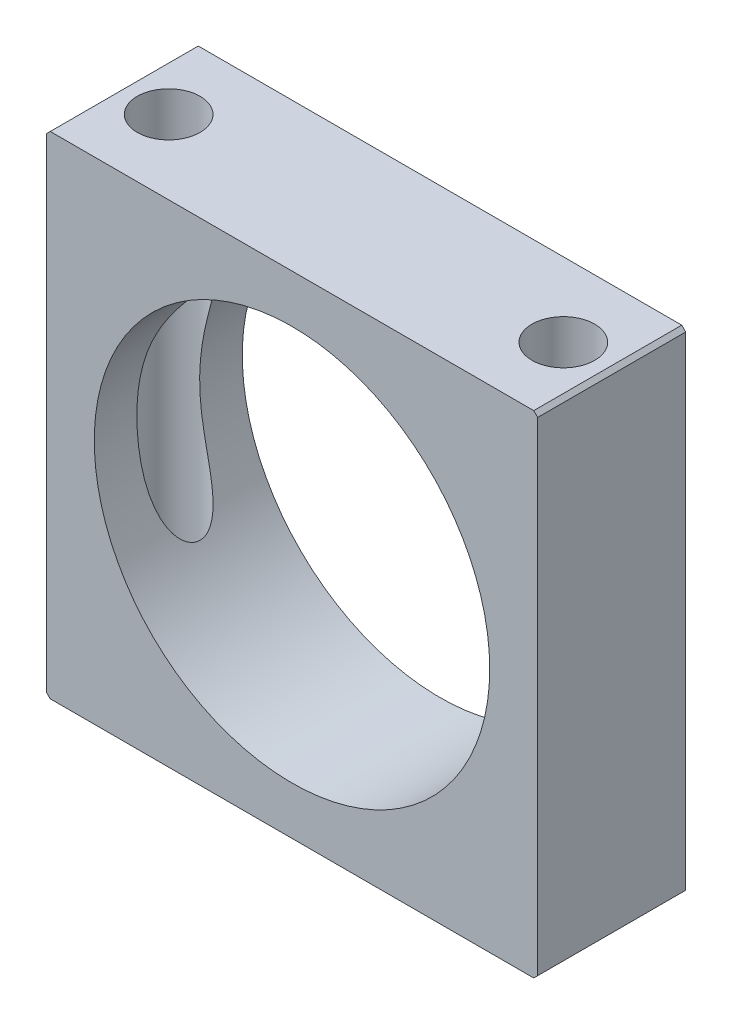
ISO-10303-21;
HEADER;
FILE_DESCRIPTION(('STEP AP214'),'2;1');
FILE_NAME('part.step','',(''),(''),'','','');
FILE_SCHEMA(('AUTOMOTIVE_DESIGN { 1 0 10303 214 1 1 1 1 }'));
ENDSEC;
DATA;
#1=APPLICATION_CONTEXT('core data for automotive mechanical design processes');
#2=APPLICATION_PROTOCOL_DEFINITION('international standard','automotive_design',2000,#1);
#3=PRODUCT_CONTEXT('',#1,'mechanical');
#4=PRODUCT('Part','Part','',(#3));
#5=PRODUCT_RELATED_PRODUCT_CATEGORY('part','',(#4));
#6=PRODUCT_DEFINITION_FORMATION('','',#4);
#7=PRODUCT_DEFINITION_CONTEXT('part definition',#1,'design');
#8=PRODUCT_DEFINITION('design','',#6,#7);
#9=PRODUCT_DEFINITION_SHAPE('','',#8);
#10=(LENGTH_UNIT() NAMED_UNIT(*) SI_UNIT(.MILLI.,.METRE.));
#11=(NAMED_UNIT(*) PLANE_ANGLE_UNIT() SI_UNIT($,.RADIAN.));
#12=(NAMED_UNIT(*) SI_UNIT($,.STERADIAN.) SOLID_ANGLE_UNIT());
#13=UNCERTAINTY_MEASURE_WITH_UNIT(LENGTH_MEASURE(1.E-05),#10,'distance_accuracy_value','');
#14=(GEOMETRIC_REPRESENTATION_CONTEXT(3) GLOBAL_UNCERTAINTY_ASSIGNED_CONTEXT((#13)) GLOBAL_UNIT_ASSIGNED_CONTEXT((#10,
#11,#12)) REPRESENTATION_CONTEXT('',''));
#15=CARTESIAN_POINT('',(0.,0.,0.));
#16=DIRECTION('',(0.,0.,1.));
#17=DIRECTION('',(1.,0.,0.));
#18=AXIS2_PLACEMENT_3D('',#15,#16,#17);
#19=CARTESIAN_POINT('',(0.,0.254000000000004,0.));
#20=DIRECTION('',(0.707106781186558,0.707106781186537,0.));
#21=DIRECTION('',(-0.707106781186537,0.707106781186558,0.));
#22=AXIS2_PLACEMENT_3D('',#19,#20,#21);
#23=PLANE('',#22);
#24=DIRECTION('',(0.,0.,1.));
#25=VECTOR('',#24,1.);
#26=CARTESIAN_POINT('',(0.253999999999997,0.,0.));
#27=LINE('',#26,#25);
#28=CARTESIAN_POINT('',(0.253999999999997,0.,9.525));
#29=VERTEX_POINT('',#28);
#30=CARTESIAN_POINT('',(0.253999999999997,0.,0.));
#31=VERTEX_POINT('',#30);
#32=EDGE_CURVE('E141',#29,#31,#27,.F.);
#33=ORIENTED_EDGE('',*,*,#32,.F.);
#34=DIRECTION('',(-0.707106781186537,0.707106781186558,0.));
#35=VECTOR('',#34,1.);
#36=CARTESIAN_POINT('',(0.,0.254000000000004,9.525));
#37=LINE('',#36,#35);
#38=CARTESIAN_POINT('',(0.,0.254000000000013,9.525));
#39=VERTEX_POINT('',#38);
#40=EDGE_CURVE('E99',#39,#29,#37,.F.);
#41=ORIENTED_EDGE('',*,*,#40,.F.);
#42=DIRECTION('',(0.,0.,1.));
#43=VECTOR('',#42,1.);
#44=CARTESIAN_POINT('',(0.,0.254000000000018,0.));
#45=LINE('',#44,#43);
#46=CARTESIAN_POINT('',(0.,0.254000000000013,0.));
#47=VERTEX_POINT('',#46);
#48=EDGE_CURVE('E98',#47,#39,#45,.T.);
#49=ORIENTED_EDGE('',*,*,#48,.F.);
#50=DIRECTION('',(0.707106781186527,-0.707106781186568,0.));
#51=VECTOR('',#50,1.);
#52=CARTESIAN_POINT('',(0.,0.254000000000015,0.));
#53=LINE('',#52,#51);
#54=EDGE_CURVE('E86',#47,#31,#53,.T.);
#55=ORIENTED_EDGE('',*,*,#54,.T.);
#56=EDGE_LOOP('',(#33,#41,#49,#55));
#57=FACE_BOUND('',#56,.T.);
#58=ADVANCED_FACE('F16',(#57),#23,.F.);
#59=CARTESIAN_POINT('',(31.369,0.,0.));
#60=DIRECTION('',(-0.707106781186547,0.707106781186548,0.));
#61=DIRECTION('',(-0.707106781186548,-0.707106781186547,0.));
#62=AXIS2_PLACEMENT_3D('',#59,#60,#61);
#63=PLANE('',#62);
#64=DIRECTION('',(0.,0.,-1.));
#65=VECTOR('',#64,1.);
#66=CARTESIAN_POINT('',(31.623,0.254000000000007,0.));
#67=LINE('',#66,#65);
#68=CARTESIAN_POINT('',(31.623,0.254000000000007,9.525));
#69=VERTEX_POINT('',#68);
#70=CARTESIAN_POINT('',(31.623,0.254000000000007,0.));
#71=VERTEX_POINT('',#70);
#72=EDGE_CURVE('E229',#69,#71,#67,.T.);
#73=ORIENTED_EDGE('',*,*,#72,.F.);
#74=DIRECTION('',(-0.707106781186548,-0.707106781186547,0.));
#75=VECTOR('',#74,1.);
#76=CARTESIAN_POINT('',(31.369,0.,9.525));
#77=LINE('',#76,#75);
#78=CARTESIAN_POINT('',(31.369,0.,9.525));
#79=VERTEX_POINT('',#78);
#80=EDGE_CURVE('E122',#79,#69,#77,.F.);
#81=ORIENTED_EDGE('',*,*,#80,.F.);
#82=DIRECTION('',(0.,0.,1.));
#83=VECTOR('',#82,1.);
#84=CARTESIAN_POINT('',(31.369,0.,0.));
#85=LINE('',#84,#83);
#86=CARTESIAN_POINT('',(31.369,0.,0.));
#87=VERTEX_POINT('',#86);
#88=EDGE_CURVE('E235',#87,#79,#85,.T.);
#89=ORIENTED_EDGE('',*,*,#88,.F.);
#90=DIRECTION('',(0.707106781186555,0.70710678118654,0.));
#91=VECTOR('',#90,1.);
#92=CARTESIAN_POINT('',(31.369,0.,0.));
#93=LINE('',#92,#91);
#94=EDGE_CURVE('E118',#87,#71,#93,.T.);
#95=ORIENTED_EDGE('',*,*,#94,.T.);
#96=EDGE_LOOP('',(#73,#81,#89,#95));
#97=FACE_BOUND('',#96,.T.);
#98=ADVANCED_FACE('F203',(#97),#63,.F.);
#99=CARTESIAN_POINT('',(28.5115,0.,4.7625));
#100=DIRECTION('',(0.,1.,0.));
#101=DIRECTION('',(0.,0.,1.));
#102=AXIS2_PLACEMENT_3D('',#99,#100,#101);
#103=CYLINDRICAL_SURFACE('',#102,2.0193);
#104=CARTESIAN_POINT('',(28.5115,0.,4.7625));
#105=DIRECTION('',(0.,1.,0.));
#106=DIRECTION('',(0.,0.,1.));
#107=AXIS2_PLACEMENT_3D('',#104,#105,#106);
#108=CIRCLE('',#107,2.0193);
#109=CARTESIAN_POINT('',(28.5115,0.,6.7818));
#110=VERTEX_POINT('',#109);
#111=EDGE_CURVE('E142',#110,#110,#108,.T.);
#112=ORIENTED_EDGE('',*,*,#111,.F.);
#113=EDGE_LOOP('',(#112));
#114=FACE_BOUND('',#113,.T.);
#115=CARTESIAN_POINT('',(28.5115,31.623,4.7625));
#116=DIRECTION('',(0.,1.,0.));
#117=DIRECTION('',(0.,0.,1.));
#118=AXIS2_PLACEMENT_3D('',#115,#116,#117);
#119=CIRCLE('',#118,2.0193);
#120=CARTESIAN_POINT('',(28.5115,31.623,6.7818));
#121=VERTEX_POINT('',#120);
#122=EDGE_CURVE('E134',#121,#121,#119,.F.);
#123=ORIENTED_EDGE('',*,*,#122,.F.);
#124=EDGE_LOOP('',(#123));
#125=FACE_BOUND('',#124,.T.);
#126=CARTESIAN_POINT('',(28.5115,16.6151200345937,2.74319999999999));
#127=CARTESIAN_POINT('',(28.5199653212104,16.4813430370531,2.74320270239754));
#128=CARTESIAN_POINT('',(28.5263158762675,16.3474399768635,2.74325062802151));
#129=CARTESIAN_POINT('',(28.5347827517717,16.0795244702182,2.74332907875549));
#130=CARTESIAN_POINT('',(28.5368999709793,15.945512053025,2.74335960755796));
#131=CARTESIAN_POINT('',(28.536900029006,15.6775559166359,2.74335990186155));
#132=CARTESIAN_POINT('',(28.5347850149188,15.5436121970708,2.7433296981734));
#133=CARTESIAN_POINT('',(28.526322201603,15.2756951322222,2.74325009105277));
#134=CARTESIAN_POINT('',(28.5199692103383,15.141721952357,2.74320066410047));
#135=CARTESIAN_POINT('',(28.5006511685445,14.836431967293,2.74319914930508));
#136=CARTESIAN_POINT('',(28.4863298494317,14.6651992426276,2.74327831319996));
#137=CARTESIAN_POINT('',(28.4507639873802,14.3234367237259,2.74403545692543));
#138=CARTESIAN_POINT('',(28.4295186182925,14.1529070158304,2.74471350822932));
#139=CARTESIAN_POINT('',(28.3801081029875,13.8126273188276,2.74732705653674));
#140=CARTESIAN_POINT('',(28.3519337391881,13.6428786777253,2.74926423423161));
#141=CARTESIAN_POINT('',(28.2887344511936,13.3047070137621,2.75527405754353));
#142=CARTESIAN_POINT('',(28.2537099752288,13.136283904916,2.75934656346674));
#143=CARTESIAN_POINT('',(28.1769646117507,12.8014278569892,2.77072658272209));
#144=CARTESIAN_POINT('',(28.1352572434751,12.6349916138971,2.77802761625686));
#145=CARTESIAN_POINT('',(28.0452092323457,12.3041426687441,2.7972347694156));
#146=CARTESIAN_POINT('',(27.9968673350173,12.1397303557952,2.80914176072264));
#147=CARTESIAN_POINT('',(27.8938736743695,11.8138519914117,2.83922573844674));
#148=CARTESIAN_POINT('',(27.8392357894094,11.6523803350742,2.85738910332814));
#149=CARTESIAN_POINT('',(27.7239329906724,11.3328225229877,2.90208533464119));
#150=CARTESIAN_POINT('',(27.6632714901554,11.1747345109502,2.92861347953247));
#151=CARTESIAN_POINT('',(27.5611040048811,10.9234282453846,2.98030993829984));
#152=CARTESIAN_POINT('',(27.5212840116499,10.8288109678863,3.00202178517003));
#153=CARTESIAN_POINT('',(27.4398400254016,10.6415939416869,3.050377247796));
#154=CARTESIAN_POINT('',(27.3982156979782,10.5489945717947,3.07702178076999));
#155=CARTESIAN_POINT('',(27.3135925758823,10.3665242495133,3.13607804401843));
#156=CARTESIAN_POINT('',(27.2705968024584,10.2766480494975,3.16847773059296));
#157=CARTESIAN_POINT('',(27.1836682807955,10.1001723616852,3.24013158612093));
#158=CARTESIAN_POINT('',(27.1397360141316,10.0135712503972,3.27938230329852));
#159=CARTESIAN_POINT('',(27.0428235727008,9.82766971518366,3.37466896265823));
#160=CARTESIAN_POINT('',(26.9897907548617,9.72929256687629,3.43249187626515));
#161=CARTESIAN_POINT('',(26.8854037535374,9.54125584218823,3.56236770191023));
#162=CARTESIAN_POINT('',(26.8340480633198,9.45158828961998,3.63440740742342));
#163=CARTESIAN_POINT('',(26.7500560588286,9.30852636786551,3.77281480481567));
#164=CARTESIAN_POINT('',(26.7161946798853,9.25199167963295,3.83515712711531));
#165=CARTESIAN_POINT('',(26.6530714006376,9.14818213783625,3.96922714840786));
#166=CARTESIAN_POINT('',(26.6238016963597,9.10089153867167,4.04093853501115));
#167=CARTESIAN_POINT('',(26.5782901191154,9.02817900877144,4.17589592751221));
#168=CARTESIAN_POINT('',(26.5606005197941,9.00022890095212,4.23727886934799));
#169=CARTESIAN_POINT('',(26.530700673956,8.9532698465948,4.36466399569805));
#170=CARTESIAN_POINT('',(26.5184864081335,8.93425434089277,4.43066275058029));
#171=CARTESIAN_POINT('',(26.5005967821325,8.90648006472163,4.56618929204118));
#172=CARTESIAN_POINT('',(26.4949681743239,8.89779462150321,4.63573869579954));
#173=CARTESIAN_POINT('',(26.4910334801698,8.89171771459723,4.77553213975767));
#174=CARTESIAN_POINT('',(26.4927247769399,8.89432221472707,4.84577592275619));
#175=CARTESIAN_POINT('',(26.502651666022,8.90967819577877,4.97686824520258));
#176=CARTESIAN_POINT('',(26.5101595332167,8.92130154238223,5.03791113034199));
#177=CARTESIAN_POINT('',(26.530196103875,8.95251309430616,5.15703949635868));
#178=CARTESIAN_POINT('',(26.5427265405966,8.97210404923387,5.21512394849178));
#179=CARTESIAN_POINT('',(26.57694270403,9.0260469027609,5.34654892578309));
#180=CARTESIAN_POINT('',(26.6002937427548,9.06315517287232,5.4183210162055));
#181=CARTESIAN_POINT('',(26.6522961811466,9.1470128956751,5.55384791767831));
#182=CARTESIAN_POINT('',(26.6809581643453,9.19378162124462,5.61758628550761));
#183=CARTESIAN_POINT('',(26.7567395024462,9.3195659189768,5.76671740611479));
#184=CARTESIAN_POINT('',(26.8059710354522,9.4030823048063,5.84720607711694));
#185=CARTESIAN_POINT('',(26.9076837203132,9.58084362320606,5.99264253749174));
#186=CARTESIAN_POINT('',(26.9601715653595,9.67511101114221,6.05755688646532));
#187=CARTESIAN_POINT('',(27.0598160898548,9.85994815666871,6.16786700297967));
#188=CARTESIAN_POINT('',(27.1069116055799,9.94974997418169,6.21463444727179));
#189=CARTESIAN_POINT('',(27.2004730258325,10.1336696801777,6.29963354602526));
#190=CARTESIAN_POINT('',(27.2469383894366,10.2277910059898,6.33785825533661));
#191=CARTESIAN_POINT('',(27.3385654476197,10.4194794845627,6.40721975903296));
#192=CARTESIAN_POINT('',(27.3837239184833,10.5170540240365,6.4383401472906));
#193=CARTESIAN_POINT('',(27.4721306897576,10.7147147019151,6.49455815108557));
#194=CARTESIAN_POINT('',(27.515379455027,10.8148002196941,6.51965723898987));
#195=CARTESIAN_POINT('',(27.6012065605999,11.020725490405,6.56566280556071));
#196=CARTESIAN_POINT('',(27.6437016974488,11.1266414750135,6.58638106462946));
#197=CARTESIAN_POINT('',(27.7260715508051,11.3402686968131,6.62333483550237));
#198=CARTESIAN_POINT('',(27.7659456990083,11.4479803170433,6.63956937753766));
#199=CARTESIAN_POINT('',(27.8814369784417,11.7735029371737,6.68275843258262));
#200=CARTESIAN_POINT('',(27.9528606496037,11.9935525731978,6.704167592949));
#201=CARTESIAN_POINT('',(28.0837726819043,12.4379435300594,6.73712794314051));
#202=CARTESIAN_POINT('',(28.1432536681567,12.6622874096153,6.74867305592211));
#203=CARTESIAN_POINT('',(28.2498686036745,13.1139815977602,6.76550530758962));
#204=CARTESIAN_POINT('',(28.2970089588245,13.3413302819456,6.77079569826742));
#205=CARTESIAN_POINT('',(28.3804709444385,13.8077062009253,6.77799711241717));
#206=CARTESIAN_POINT('',(28.4162676544204,14.0468290783341,6.77976014095217));
#207=CARTESIAN_POINT('',(28.4741517207061,14.5264596465523,6.7816630688818));
#208=CARTESIAN_POINT('',(28.4962550825482,14.7669653877115,6.78180486665852));
#209=CARTESIAN_POINT('',(28.5199653212104,15.1416569629469,6.78179729760245));
#210=CARTESIAN_POINT('',(28.5263158762675,15.2755600231365,6.78174937197848));
#211=CARTESIAN_POINT('',(28.5347827517717,15.5434755297818,6.7816709212445));
#212=CARTESIAN_POINT('',(28.5368999709793,15.677487946975,6.78164039244203));
#213=CARTESIAN_POINT('',(28.536900029006,15.9454440833641,6.78164009813845));
#214=CARTESIAN_POINT('',(28.5347850149188,16.0793878029292,6.7816703018266));
#215=CARTESIAN_POINT('',(28.526322201603,16.3473048677777,6.78174990894722));
#216=CARTESIAN_POINT('',(28.5199692103383,16.481278047643,6.78179933589952));
#217=CARTESIAN_POINT('',(28.5006511685445,16.786568032707,6.78180085069491));
#218=CARTESIAN_POINT('',(28.4863298494317,16.9578007573724,6.78172168680003));
#219=CARTESIAN_POINT('',(28.4507639873802,17.2995632762741,6.78096454307456));
#220=CARTESIAN_POINT('',(28.4295186182925,17.4700929841696,6.78028649177068));
#221=CARTESIAN_POINT('',(28.3801081029875,17.8103726811724,6.77767294346325));
#222=CARTESIAN_POINT('',(28.3519337391881,17.9801213222747,6.77573576576838));
#223=CARTESIAN_POINT('',(28.2887344511936,18.3182929862379,6.76972594245647));
#224=CARTESIAN_POINT('',(28.2537099752288,18.486716095084,6.76565343653326));
#225=CARTESIAN_POINT('',(28.1769646117507,18.8215721430108,6.75427341727791));
#226=CARTESIAN_POINT('',(28.1352572434751,18.9880083861029,6.74697238374313));
#227=CARTESIAN_POINT('',(28.0452092323457,19.3188573312559,6.7277652305844));
#228=CARTESIAN_POINT('',(27.9968673350173,19.4832696442048,6.71585823927735));
#229=CARTESIAN_POINT('',(27.8938736743695,19.8091480085883,6.68577426155325));
#230=CARTESIAN_POINT('',(27.8392357894094,19.9706196649258,6.66761089667185));
#231=CARTESIAN_POINT('',(27.7239329906724,20.2901774770123,6.6229146653588));
#232=CARTESIAN_POINT('',(27.6632714901554,20.4482654890498,6.59638652046752));
#233=CARTESIAN_POINT('',(27.5611040048811,20.6995717546154,6.54469006170015));
#234=CARTESIAN_POINT('',(27.5212840116499,20.7941890321136,6.52297821482996));
#235=CARTESIAN_POINT('',(27.4398400254016,20.9814060583131,6.47462275220399));
#236=CARTESIAN_POINT('',(27.3982156979782,21.0740054282053,6.44797821923));
#237=CARTESIAN_POINT('',(27.3135925758823,21.2564757504867,6.38892195598156));
#238=CARTESIAN_POINT('',(27.2705968024584,21.3463519505025,6.35652226940703));
#239=CARTESIAN_POINT('',(27.1836682807954,21.5228276383148,6.28486841387906));
#240=CARTESIAN_POINT('',(27.1397360141316,21.6094287496028,6.24561769670148));
#241=CARTESIAN_POINT('',(27.0428235727008,21.7953302848163,6.15033103734176));
#242=CARTESIAN_POINT('',(26.9897907548617,21.8937074331237,6.09250812373485));
#243=CARTESIAN_POINT('',(26.8854037535374,22.0817441578118,5.96263229808976));
#244=CARTESIAN_POINT('',(26.8340480633198,22.17141171038,5.89059259257657));
#245=CARTESIAN_POINT('',(26.7500560588286,22.3144736321345,5.75218519518432));
#246=CARTESIAN_POINT('',(26.7161946798853,22.371008320367,5.68984287288469));
#247=CARTESIAN_POINT('',(26.6530714006376,22.4748178621637,5.55577285159213));
#248=CARTESIAN_POINT('',(26.6238016963597,22.5221084613283,5.48406146498885));
#249=CARTESIAN_POINT('',(26.5782901191154,22.5948209912286,5.34910407248778));
#250=CARTESIAN_POINT('',(26.5606005197941,22.6227710990479,5.28772113065201));
#251=CARTESIAN_POINT('',(26.530700673956,22.6697301534052,5.16033600430194));
#252=CARTESIAN_POINT('',(26.5184864081335,22.6887456591072,5.0943372494197));
#253=CARTESIAN_POINT('',(26.5005967821325,22.7165199352784,4.95881070795881));
#254=CARTESIAN_POINT('',(26.4949681743239,22.7252053784968,4.88926130420045));
#255=CARTESIAN_POINT('',(26.4910334801698,22.7312822854028,4.74946786024232));
#256=CARTESIAN_POINT('',(26.4927247769399,22.7286777852729,4.6792240772438));
#257=CARTESIAN_POINT('',(26.502651666022,22.7133218042212,4.54813175479741));
#258=CARTESIAN_POINT('',(26.5101595332167,22.7016984576178,4.487088869658));
#259=CARTESIAN_POINT('',(26.530196103875,22.6704869056938,4.36796050364131));
#260=CARTESIAN_POINT('',(26.5427265405966,22.6508959507661,4.30987605150821));
#261=CARTESIAN_POINT('',(26.57694270403,22.5969530972391,4.1784510742169));
#262=CARTESIAN_POINT('',(26.6002937427548,22.5598448271277,4.10667898379449));
#263=CARTESIAN_POINT('',(26.6522961811466,22.4759871043249,3.97115208232168));
#264=CARTESIAN_POINT('',(26.6809581643453,22.4292183787554,3.90741371449238));
#265=CARTESIAN_POINT('',(26.7567395024462,22.3034340810232,3.7582825938852));
#266=CARTESIAN_POINT('',(26.8059710354522,22.2199176951937,3.67779392288305));
#267=CARTESIAN_POINT('',(26.9076837203132,22.0421563767939,3.53235746250825));
#268=CARTESIAN_POINT('',(26.9601715653595,21.9478889888578,3.46744311353467));
#269=CARTESIAN_POINT('',(27.0598160898548,21.7630518433313,3.35713299702032));
#270=CARTESIAN_POINT('',(27.1069116055799,21.6732500258183,3.3103655527282));
#271=CARTESIAN_POINT('',(27.2004730258325,21.4893303198223,3.22536645397473));
#272=CARTESIAN_POINT('',(27.2469383894366,21.3952089940102,3.18714174466338));
#273=CARTESIAN_POINT('',(27.3385654476197,21.2035205154373,3.11778024096703));
#274=CARTESIAN_POINT('',(27.3837239184833,21.1059459759635,3.08665985270939));
#275=CARTESIAN_POINT('',(27.4721306897576,20.9082852980849,3.03044184891442));
#276=CARTESIAN_POINT('',(27.515379455027,20.8081997803059,3.00534276101012));
#277=CARTESIAN_POINT('',(27.6012065605999,20.602274509595,2.95933719443928));
#278=CARTESIAN_POINT('',(27.6437016974488,20.4963585249865,2.93861893537053));
#279=CARTESIAN_POINT('',(27.7260715508051,20.2827313031868,2.90166516449762));
#280=CARTESIAN_POINT('',(27.7659456990083,20.1750196829567,2.88543062246233));
#281=CARTESIAN_POINT('',(27.8814369784417,19.8494970628263,2.84224156741738));
#282=CARTESIAN_POINT('',(27.9528606496037,19.6294474268022,2.82083240705099));
#283=CARTESIAN_POINT('',(28.0837726819043,19.1850564699406,2.78787205685948));
#284=CARTESIAN_POINT('',(28.1432536681567,18.9607125903847,2.77632694407788));
#285=CARTESIAN_POINT('',(28.2498686036745,18.5090184022398,2.75949469241037));
#286=CARTESIAN_POINT('',(28.2970089588245,18.2816697180544,2.75420430173257));
#287=CARTESIAN_POINT('',(28.3804709444385,17.8152937990747,2.74700288758283));
#288=CARTESIAN_POINT('',(28.4162676544204,17.5761709216659,2.74523985904783));
#289=CARTESIAN_POINT('',(28.4741517207061,17.0965403534477,2.74333693111819));
#290=CARTESIAN_POINT('',(28.4962550825482,16.8560346122885,2.74319513334148));
#291=CARTESIAN_POINT('',(28.5115,16.6151200345937,2.74319999999999));
#292=B_SPLINE_CURVE_WITH_KNOTS('',3,(#126,#127,#128,#129,#130,#131,#132,#133,#134,#135,#136,
#137,#138,#139,#140,#141,#142,#143,#144,#145,#146,#147,#148,#149,#150,#151,#152,#153,#154,#155,
#156,#157,#158,#159,#160,#161,#162,#163,#164,#165,#166,#167,#168,#169,#170,#171,#172,#173,#174,
#175,#176,#177,#178,#179,#180,#181,#182,#183,#184,#185,#186,#187,#188,#189,#190,#191,#192,#193,
#194,#195,#196,#197,#198,#199,#200,#201,#202,#203,#204,#205,#206,#207,#208,#209,#210,#211,#212,
#213,#214,#215,#216,#217,#218,#219,#220,#221,#222,#223,#224,#225,#226,#227,#228,#229,#230,#231,
#232,#233,#234,#235,#236,#237,#238,#239,#240,#241,#242,#243,#244,#245,#246,#247,#248,#249,#250,
#251,#252,#253,#254,#255,#256,#257,#258,#259,#260,#261,#262,#263,#264,#265,#266,#267,#268,#269,
#270,#271,#272,#273,#274,#275,#276,#277,#278,#279,#280,#281,#282,#283,#284,#285,#286,#287,#288,
#289,#290,#291),.UNSPECIFIED.,.T.,.F.,(4,2,2,2,2,2,2,2,2,2,2,2,2,2,2,2,2,2,2,2,2,2,2,2,2,2,2,2,
2,2,2,2,2,2,2,2,2,2,2,2,2,2,2,2,2,2,2,2,2,2,2,2,2,2,2,2,2,2,2,2,2,2,2,2,2,2,2,2,2,2,2,2,2,2,2,2,
2,2,2,2,2,2,4),(0.,0.40210354142174,0.804121705000044,1.20593596872273,1.6082434099645,
2.12358845973877,2.63899502087777,3.15509096730215,3.67115315477977,4.18618425078339,
4.70131286476891,5.21532694358039,5.72905140248845,6.04370670327851,6.35842057215425,
6.67248344208353,6.98638853111204,7.36306166959052,7.73938653512679,8.01071437980907,
8.28157596150202,8.4899567200692,8.69818426001524,8.90788123152498,9.11750324203387,
9.30444924962508,9.49145982676311,9.74236854129282,9.99378274603126,10.3696803912375,
10.7463780630539,11.0808945812981,11.4156820764171,11.7512350524477,12.0867058930888,
12.4345188051393,12.7824068857297,13.4786748948486,14.1753715521646,14.8717058416363,
15.5966898402826,16.3208248309917,16.7229283724135,17.1249465359918,17.5267607997144,
17.9290682409562,18.4444132907305,18.9598198518695,19.4759157982939,19.9919779857715,
20.5070090817751,21.0221376957606,21.5361517745721,22.0498762334802,22.3645315342702,
22.679245403146,22.9933082730753,23.3072133621038,23.6838865005822,24.0602113661185,
24.3315392108008,24.6024007924937,24.8107815510609,25.019009091007,25.2287060625167,
25.4383280730256,25.6252740806168,25.8122846577548,26.0631933722846,26.314607577023,
26.6905052222292,27.0672028940456,27.4017194122898,27.7365069074088,28.0720598834394,
28.4075307240805,28.7553436361311,29.1032317167214,29.7994997258403,30.4961963831563,
31.1925306726281,31.9175146712743,32.6416496619835),.UNSPECIFIED.);
#293=CARTESIAN_POINT('',(28.5115,16.6151200345937,2.74319999999999));
#294=VERTEX_POINT('',#293);
#295=EDGE_CURVE('E19',#294,#294,#292,.T.);
#296=ORIENTED_EDGE('',*,*,#295,.T.);
#297=EDGE_LOOP('',(#296));
#298=FACE_BOUND('',#297,.T.);
#299=ADVANCED_FACE('F171',(#114,#125,#298),#103,.F.);
#300=CARTESIAN_POINT('',(3.1115,0.,4.7625));
#301=DIRECTION('',(0.,1.,0.));
#302=DIRECTION('',(0.,0.,1.));
#303=AXIS2_PLACEMENT_3D('',#300,#301,#302);
#304=CYLINDRICAL_SURFACE('',#303,2.0193);
#305=CARTESIAN_POINT('',(3.1115,16.6151200345936,6.7818));
#306=CARTESIAN_POINT('',(3.10303467878958,16.481343037053,6.78179729760245));
#307=CARTESIAN_POINT('',(3.09668412373254,16.3474399768634,6.78174937197848));
#308=CARTESIAN_POINT('',(3.08821724822826,16.0795244702181,6.7816709212445));
#309=CARTESIAN_POINT('',(3.08610002902073,15.945512053025,6.78164039244204));
#310=CARTESIAN_POINT('',(3.08609997099397,15.677555916636,6.78164009813845));
#311=CARTESIAN_POINT('',(3.08821498508121,15.5436121970708,6.7816703018266));
#312=CARTESIAN_POINT('',(3.09667779839696,15.2756951322223,6.78174990894723));
#313=CARTESIAN_POINT('',(3.10303078966174,15.1417219523571,6.78179933589952));
#314=CARTESIAN_POINT('',(3.12234883145549,14.8364319672931,6.78180085069491));
#315=CARTESIAN_POINT('',(3.13667015056824,14.6651992426277,6.78172168680004));
#316=CARTESIAN_POINT('',(3.17223601261975,14.323436723726,6.78096454307456));
#317=CARTESIAN_POINT('',(3.1934813817075,14.1529070158306,6.78028649177068));
#318=CARTESIAN_POINT('',(3.24289189701244,13.8126273188277,6.77767294346325));
#319=CARTESIAN_POINT('',(3.27106626081184,13.6428786777255,6.77573576576838));
#320=CARTESIAN_POINT('',(3.33426554880642,13.3047070137623,6.76972594245647));
#321=CARTESIAN_POINT('',(3.36929002477115,13.1362839049161,6.76565343653326));
#322=CARTESIAN_POINT('',(3.44603538824928,12.8014278569893,6.75427341727791));
#323=CARTESIAN_POINT('',(3.48774275652484,12.6349916138972,6.74697238374314));
#324=CARTESIAN_POINT('',(3.57779076765423,12.3041426687442,6.7277652305844));
#325=CARTESIAN_POINT('',(3.6261326649827,12.1397303557953,6.71585823927736));
#326=CARTESIAN_POINT('',(3.72912632563049,11.8138519914118,6.68577426155326));
#327=CARTESIAN_POINT('',(3.78376421059059,11.6523803350743,6.66761089667187));
#328=CARTESIAN_POINT('',(3.89906700932753,11.3328225229879,6.62291466535881));
#329=CARTESIAN_POINT('',(3.95972850984452,11.1747345109503,6.59638652046754));
#330=CARTESIAN_POINT('',(4.0618959951189,10.9234282453847,6.54469006170017));
#331=CARTESIAN_POINT('',(4.1017159883501,10.8288109678864,6.52297821482998));
#332=CARTESIAN_POINT('',(4.18315997459838,10.6415939416869,6.47462275220401));
#333=CARTESIAN_POINT('',(4.22478430202177,10.5489945717947,6.44797821923002));
#334=CARTESIAN_POINT('',(4.30940742411767,10.3665242495133,6.38892195598158));
#335=CARTESIAN_POINT('',(4.35240319754159,10.2766480494976,6.35652226940705));
#336=CARTESIAN_POINT('',(4.43933171920453,10.1001723616853,6.28486841387908));
#337=CARTESIAN_POINT('',(4.48326398586839,10.0135712503973,6.24561769670149));
#338=CARTESIAN_POINT('',(4.58017642729918,9.82766971518369,6.15033103734177));
#339=CARTESIAN_POINT('',(4.6332092451383,9.72929256687632,6.09250812373486));
#340=CARTESIAN_POINT('',(4.7375962464626,9.54125584218826,5.96263229808978));
#341=CARTESIAN_POINT('',(4.78895193668016,9.45158828962002,5.89059259257659));
#342=CARTESIAN_POINT('',(4.87294394117134,9.30852636786555,5.75218519518435));
#343=CARTESIAN_POINT('',(4.90680532011464,9.25199167963299,5.68984287288471));
#344=CARTESIAN_POINT('',(4.96992859936243,9.14818213783628,5.55577285159216));
#345=CARTESIAN_POINT('',(4.99919830364024,9.1008915386717,5.48406146498887));
#346=CARTESIAN_POINT('',(5.04470988088462,9.02817900877146,5.3491040724878));
#347=CARTESIAN_POINT('',(5.06239948020592,9.00022890095214,5.28772113065203));
#348=CARTESIAN_POINT('',(5.09229932604396,8.95326984659481,5.16033600430196));
#349=CARTESIAN_POINT('',(5.10451359186649,8.93425434089279,5.09433724941972));
#350=CARTESIAN_POINT('',(5.12240321786751,8.90648006472165,4.95881070795883));
#351=CARTESIAN_POINT('',(5.12803182567607,8.89779462150323,4.88926130420047));
#352=CARTESIAN_POINT('',(5.13196651983023,8.89171771459725,4.74946786024234));
#353=CARTESIAN_POINT('',(5.13027522306011,8.89432221472708,4.67922407724382));
#354=CARTESIAN_POINT('',(5.12034833397796,8.90967819577878,4.54813175479743));
#355=CARTESIAN_POINT('',(5.11284046678328,8.92130154238224,4.48708886965802));
#356=CARTESIAN_POINT('',(5.09280389612503,8.95251309430617,4.36796050364133));
#357=CARTESIAN_POINT('',(5.08027345940335,8.97210404923388,4.30987605150823));
#358=CARTESIAN_POINT('',(5.04605729597002,9.02604690276091,4.17845107421692));
#359=CARTESIAN_POINT('',(5.02270625724518,9.06315517287233,4.10667898379451));
#360=CARTESIAN_POINT('',(4.97070381885335,9.1470128956751,3.9711520823217));
#361=CARTESIAN_POINT('',(4.94204183565467,9.19378162124462,3.9074137144924));
#362=CARTESIAN_POINT('',(4.86626049755376,9.3195659189768,3.75828259388523));
#363=CARTESIAN_POINT('',(4.81702896454783,9.4030823048063,3.67779392288308));
#364=CARTESIAN_POINT('',(4.71531627968681,9.58084362320606,3.53235746250828));
#365=CARTESIAN_POINT('',(4.66282843464055,9.6751110111422,3.4674431135347));
#366=CARTESIAN_POINT('',(4.56318391014516,9.8599481566687,3.35713299702035));
#367=CARTESIAN_POINT('',(4.5160883944201,9.94974997418167,3.31036555272823));
#368=CARTESIAN_POINT('',(4.42252697416751,10.1336696801777,3.22536645397475));
#369=CARTESIAN_POINT('',(4.37606161056346,10.2277910059898,3.1871417446634));
#370=CARTESIAN_POINT('',(4.28443455238028,10.4194794845627,3.11778024096705));
#371=CARTESIAN_POINT('',(4.23927608151668,10.5170540240364,3.08665985270942));
#372=CARTESIAN_POINT('',(4.15086931024237,10.7147147019151,3.03044184891444));
#373=CARTESIAN_POINT('',(4.10762054497305,10.8148002196941,3.00534276101014));
#374=CARTESIAN_POINT('',(4.02179343940012,11.020725490405,2.9593371944393));
#375=CARTESIAN_POINT('',(3.97929830255117,11.1266414750134,2.93861893537055));
#376=CARTESIAN_POINT('',(3.89692844919489,11.3402686968131,2.90166516449764));
#377=CARTESIAN_POINT('',(3.85705430099169,11.4479803170432,2.88543062246235));
#378=CARTESIAN_POINT('',(3.74156302155836,11.7735029371737,2.84224156741739));
#379=CARTESIAN_POINT('',(3.67013935039628,11.9935525731977,2.820832407051));
#380=CARTESIAN_POINT('',(3.53922731809574,12.4379435300593,2.78787205685949));
#381=CARTESIAN_POINT('',(3.47974633184333,12.6622874096152,2.77632694407789));
#382=CARTESIAN_POINT('',(3.37313139632555,13.1139815977601,2.75949469241038));
#383=CARTESIAN_POINT('',(3.32599104117548,13.3413302819455,2.75420430173258));
#384=CARTESIAN_POINT('',(3.2425290555615,13.8077062009252,2.74700288758283));
#385=CARTESIAN_POINT('',(3.20673234557958,14.046829078334,2.74523985904783));
#386=CARTESIAN_POINT('',(3.14884827929394,14.5264596465523,2.7433369311182));
#387=CARTESIAN_POINT('',(3.12674491745181,14.7669653877116,2.74319513334148));
#388=CARTESIAN_POINT('',(3.10303467878959,15.141656962947,2.74320270239755));
#389=CARTESIAN_POINT('',(3.09668412373254,15.2755600231366,2.74325062802152));
#390=CARTESIAN_POINT('',(3.08821724822826,15.5434755297819,2.7433290787555));
#391=CARTESIAN_POINT('',(3.08610002902073,15.677487946975,2.74335960755796));
#392=CARTESIAN_POINT('',(3.08609997099397,15.945444083364,2.74335990186155));
#393=CARTESIAN_POINT('',(3.08821498508121,16.0793878029292,2.7433296981734));
#394=CARTESIAN_POINT('',(3.09667779839696,16.3473048677777,2.74325009105277));
#395=CARTESIAN_POINT('',(3.10303078966174,16.4812780476429,2.74320066410048));
#396=CARTESIAN_POINT('',(3.12234883145549,16.7865680327069,2.74319914930509));
#397=CARTESIAN_POINT('',(3.13667015056824,16.9578007573723,2.74327831319997));
#398=CARTESIAN_POINT('',(3.17223601261975,17.299563276274,2.74403545692544));
#399=CARTESIAN_POINT('',(3.1934813817075,17.4700929841694,2.74471350822932));
#400=CARTESIAN_POINT('',(3.24289189701244,17.8103726811723,2.74732705653675));
#401=CARTESIAN_POINT('',(3.27106626081184,17.9801213222745,2.74926423423162));
#402=CARTESIAN_POINT('',(3.33426554880642,18.3182929862377,2.75527405754353));
#403=CARTESIAN_POINT('',(3.36929002477116,18.4867160950839,2.75934656346674));
#404=CARTESIAN_POINT('',(3.44603538824928,18.8215721430107,2.77072658272209));
#405=CARTESIAN_POINT('',(3.48774275652484,18.9880083861028,2.77802761625686));
#406=CARTESIAN_POINT('',(3.57779076765423,19.3188573312558,2.7972347694156));
#407=CARTESIAN_POINT('',(3.6261326649827,19.4832696442047,2.80914176072264));
#408=CARTESIAN_POINT('',(3.72912632563049,19.8091480085882,2.83922573844674));
#409=CARTESIAN_POINT('',(3.78376421059059,19.9706196649257,2.85738910332813));
#410=CARTESIAN_POINT('',(3.89906700932753,20.2901774770121,2.90208533464118));
#411=CARTESIAN_POINT('',(3.95972850984451,20.4482654890497,2.92861347953246));
#412=CARTESIAN_POINT('',(4.06189599511889,20.6995717546153,2.98030993829983));
#413=CARTESIAN_POINT('',(4.1017159883501,20.7941890321135,3.00202178517002));
#414=CARTESIAN_POINT('',(4.18315997459838,20.9814060583131,3.05037724779599));
#415=CARTESIAN_POINT('',(4.22478430202177,21.0740054282053,3.07702178076998));
#416=CARTESIAN_POINT('',(4.30940742411767,21.2564757504867,3.13607804401842));
#417=CARTESIAN_POINT('',(4.35240319754159,21.3463519505024,3.16847773059295));
#418=CARTESIAN_POINT('',(4.43933171920453,21.5228276383147,3.24013158612092));
#419=CARTESIAN_POINT('',(4.48326398586839,21.6094287496027,3.27938230329851));
#420=CARTESIAN_POINT('',(4.58017642729917,21.7953302848163,3.37466896265823));
#421=CARTESIAN_POINT('',(4.6332092451383,21.8937074331237,3.43249187626514));
#422=CARTESIAN_POINT('',(4.7375962464626,22.0817441578117,3.56236770191022));
#423=CARTESIAN_POINT('',(4.78895193668016,22.17141171038,3.63440740742341));
#424=CARTESIAN_POINT('',(4.87294394117134,22.3144736321345,3.77281480481565));
#425=CARTESIAN_POINT('',(4.90680532011464,22.371008320367,3.83515712711529));
#426=CARTESIAN_POINT('',(4.96992859936243,22.4748178621637,3.96922714840784));
#427=CARTESIAN_POINT('',(4.99919830364024,22.5221084613283,4.04093853501113));
#428=CARTESIAN_POINT('',(5.04470988088462,22.5948209912285,4.1758959275122));
#429=CARTESIAN_POINT('',(5.06239948020592,22.6227710990479,4.23727886934797));
#430=CARTESIAN_POINT('',(5.09229932604396,22.6697301534052,4.36466399569803));
#431=CARTESIAN_POINT('',(5.10451359186649,22.6887456591072,4.43066275058027));
#432=CARTESIAN_POINT('',(5.12240321786751,22.7165199352784,4.56618929204116));
#433=CARTESIAN_POINT('',(5.12803182567607,22.7252053784968,4.63573869579952));
#434=CARTESIAN_POINT('',(5.13196651983022,22.7312822854027,4.77553213975766));
#435=CARTESIAN_POINT('',(5.13027522306011,22.7286777852729,4.84577592275618));
#436=CARTESIAN_POINT('',(5.12034833397796,22.7133218042212,4.97686824520257));
#437=CARTESIAN_POINT('',(5.11284046678328,22.7016984576178,5.03791113034198));
#438=CARTESIAN_POINT('',(5.09280389612503,22.6704869056938,5.15703949635867));
#439=CARTESIAN_POINT('',(5.08027345940335,22.6508959507661,5.21512394849176));
#440=CARTESIAN_POINT('',(5.04605729597002,22.5969530972391,5.34654892578307));
#441=CARTESIAN_POINT('',(5.02270625724518,22.5598448271277,5.41832101620549));
#442=CARTESIAN_POINT('',(4.97070381885335,22.4759871043249,5.55384791767829));
#443=CARTESIAN_POINT('',(4.94204183565467,22.4292183787554,5.61758628550759));
#444=CARTESIAN_POINT('',(4.86626049755376,22.3034340810232,5.76671740611477));
#445=CARTESIAN_POINT('',(4.81702896454783,22.2199176951937,5.84720607711692));
#446=CARTESIAN_POINT('',(4.71531627968682,22.042156376794,5.99264253749171));
#447=CARTESIAN_POINT('',(4.66282843464056,21.9478889888578,6.05755688646529));
#448=CARTESIAN_POINT('',(4.56318391014517,21.7630518433313,6.16786700297965));
#449=CARTESIAN_POINT('',(4.5160883944201,21.6732500258183,6.21463444727176));
#450=CARTESIAN_POINT('',(4.42252697416752,21.4893303198223,6.29963354602524));
#451=CARTESIAN_POINT('',(4.37606161056347,21.3952089940102,6.33785825533659));
#452=CARTESIAN_POINT('',(4.28443455238029,21.2035205154373,6.40721975903294));
#453=CARTESIAN_POINT('',(4.23927608151669,21.1059459759636,6.43834014729058));
#454=CARTESIAN_POINT('',(4.15086931024238,20.9082852980849,6.49455815108555));
#455=CARTESIAN_POINT('',(4.10762054497306,20.8081997803059,6.51965723898986));
#456=CARTESIAN_POINT('',(4.02179343940013,20.6022745095951,6.5656628055607));
#457=CARTESIAN_POINT('',(3.97929830255118,20.4963585249866,6.58638106462944));
#458=CARTESIAN_POINT('',(3.8969284491949,20.2827313031869,6.62333483550236));
#459=CARTESIAN_POINT('',(3.85705430099171,20.1750196829568,6.63956937753765));
#460=CARTESIAN_POINT('',(3.74156302155837,19.8494970628264,6.68275843258261));
#461=CARTESIAN_POINT('',(3.67013935039629,19.6294474268023,6.70416759294899));
#462=CARTESIAN_POINT('',(3.53922731809575,19.1850564699407,6.73712794314051));
#463=CARTESIAN_POINT('',(3.47974633184335,18.9607125903848,6.74867305592211));
#464=CARTESIAN_POINT('',(3.37313139632556,18.5090184022399,6.76550530758962));
#465=CARTESIAN_POINT('',(3.32599104117549,18.2816697180546,6.77079569826742));
#466=CARTESIAN_POINT('',(3.24252905556151,17.8152937990748,6.77799711241717));
#467=CARTESIAN_POINT('',(3.20673234557958,17.576170921666,6.77976014095217));
#468=CARTESIAN_POINT('',(3.14884827929394,17.0965403534477,6.7816630688818));
#469=CARTESIAN_POINT('',(3.12674491745181,16.8560346122884,6.78180486665852));
#470=CARTESIAN_POINT('',(3.1115,16.6151200345936,6.7818));
#471=B_SPLINE_CURVE_WITH_KNOTS('',3,(#305,#306,#307,#308,#309,#310,#311,#312,#313,#314,#315,
#316,#317,#318,#319,#320,#321,#322,#323,#324,#325,#326,#327,#328,#329,#330,#331,#332,#333,#334,
#335,#336,#337,#338,#339,#340,#341,#342,#343,#344,#345,#346,#347,#348,#349,#350,#351,#352,#353,
#354,#355,#356,#357,#358,#359,#360,#361,#362,#363,#364,#365,#366,#367,#368,#369,#370,#371,#372,
#373,#374,#375,#376,#377,#378,#379,#380,#381,#382,#383,#384,#385,#386,#387,#388,#389,#390,#391,
#392,#393,#394,#395,#396,#397,#398,#399,#400,#401,#402,#403,#404,#405,#406,#407,#408,#409,#410,
#411,#412,#413,#414,#415,#416,#417,#418,#419,#420,#421,#422,#423,#424,#425,#426,#427,#428,#429,
#430,#431,#432,#433,#434,#435,#436,#437,#438,#439,#440,#441,#442,#443,#444,#445,#446,#447,#448,
#449,#450,#451,#452,#453,#454,#455,#456,#457,#458,#459,#460,#461,#462,#463,#464,#465,#466,#467,
#468,#469,#470),.UNSPECIFIED.,.T.,.F.,(4,2,2,2,2,2,2,2,2,2,2,2,2,2,2,2,2,2,2,2,2,2,2,2,2,2,2,2,
2,2,2,2,2,2,2,2,2,2,2,2,2,2,2,2,2,2,2,2,2,2,2,2,2,2,2,2,2,2,2,2,2,2,2,2,2,2,2,2,2,2,2,2,2,2,2,2,
2,2,2,2,2,2,4),(0.,0.402103541421681,0.804121704999922,1.20593596872255,1.60824340996427,
2.12358845973853,2.63899502087753,3.15509096730192,3.67115315477953,4.18618425078316,
4.70131286476868,5.21532694358015,5.72905140248821,6.04370670327829,6.35842057215406,
6.67248344208336,6.98638853111189,7.36306166959035,7.73938653512661,8.0107143798089,
8.28157596150186,8.48995672006905,8.69818426001509,8.90788123152483,9.11750324203372,
9.30444924962494,9.49145982676296,9.74236854129267,9.9937827460311,10.3696803912373,
10.7463780630537,11.0808945812979,11.4156820764169,11.7512350524475,12.0867058930886,
12.4345188051391,12.7824068857295,13.4786748948484,14.1753715521643,14.8717058416361,
15.5966898402824,16.3208248309917,16.7229283724134,17.1249465359916,17.5267607997142,
17.9290682409559,18.4444132907302,18.9598198518692,19.4759157982936,19.9919779857712,
20.5070090817748,21.0221376957603,21.5361517745718,22.0498762334799,22.36453153427,
22.6792454031457,22.993308273075,23.3072133621036,23.683886500582,24.0602113661183,
24.3315392108006,24.6024007924935,24.8107815510607,25.0190090910068,25.2287060625165,
25.4383280730254,25.6252740806166,25.8122846577546,26.0631933722843,26.3146075770228,
26.690505222229,27.0672028940454,27.4017194122895,27.7365069074086,28.0720598834391,
28.4075307240802,28.7553436361307,29.1032317167211,29.79949972584,30.4961963831559,
31.1925306726277,31.9175146712741,32.6416496619834),.UNSPECIFIED.);
#472=CARTESIAN_POINT('',(3.1115,16.6151200345936,6.7818));
#473=VERTEX_POINT('',#472);
#474=EDGE_CURVE('E110',#473,#473,#471,.T.);
#475=ORIENTED_EDGE('',*,*,#474,.T.);
#476=EDGE_LOOP('',(#475));
#477=FACE_BOUND('',#476,.T.);
#478=CARTESIAN_POINT('',(3.1115,31.623,4.7625));
#479=DIRECTION('',(0.,1.,0.));
#480=DIRECTION('',(0.,0.,1.));
#481=AXIS2_PLACEMENT_3D('',#478,#479,#480);
#482=CIRCLE('',#481,2.0193);
#483=CARTESIAN_POINT('',(3.1115,31.623,6.7818));
#484=VERTEX_POINT('',#483);
#485=EDGE_CURVE('E130',#484,#484,#482,.F.);
#486=ORIENTED_EDGE('',*,*,#485,.F.);
#487=EDGE_LOOP('',(#486));
#488=FACE_BOUND('',#487,.T.);
#489=CARTESIAN_POINT('',(3.1115,0.,4.7625));
#490=DIRECTION('',(0.,1.,0.));
#491=DIRECTION('',(0.,0.,1.));
#492=AXIS2_PLACEMENT_3D('',#489,#490,#491);
#493=CIRCLE('',#492,2.0193);
#494=CARTESIAN_POINT('',(3.1115,0.,6.7818));
#495=VERTEX_POINT('',#494);
#496=EDGE_CURVE('E138',#495,#495,#493,.T.);
#497=ORIENTED_EDGE('',*,*,#496,.F.);
#498=EDGE_LOOP('',(#497));
#499=FACE_BOUND('',#498,.T.);
#500=ADVANCED_FACE('F149',(#477,#488,#499),#304,.F.);
#501=CARTESIAN_POINT('',(31.623,31.369,0.));
#502=DIRECTION('',(-0.707106781186548,-0.707106781186548,0.));
#503=DIRECTION('',(0.707106781186548,-0.707106781186548,0.));
#504=AXIS2_PLACEMENT_3D('',#501,#502,#503);
#505=PLANE('',#504);
#506=DIRECTION('',(0.,0.,1.));
#507=VECTOR('',#506,1.);
#508=CARTESIAN_POINT('',(31.369,31.623,0.));
#509=LINE('',#508,#507);
#510=CARTESIAN_POINT('',(31.369,31.623,9.525));
#511=VERTEX_POINT('',#510);
#512=CARTESIAN_POINT('',(31.369,31.623,0.));
#513=VERTEX_POINT('',#512);
#514=EDGE_CURVE('E133',#511,#513,#509,.F.);
#515=ORIENTED_EDGE('',*,*,#514,.F.);
#516=DIRECTION('',(0.707106781186548,-0.707106781186548,0.));
#517=VECTOR('',#516,1.);
#518=CARTESIAN_POINT('',(31.623,31.369,9.525));
#519=LINE('',#518,#517);
#520=CARTESIAN_POINT('',(31.623,31.369,9.525));
#521=VERTEX_POINT('',#520);
#522=EDGE_CURVE('E120',#521,#511,#519,.F.);
#523=ORIENTED_EDGE('',*,*,#522,.F.);
#524=DIRECTION('',(0.,0.,-1.));
#525=VECTOR('',#524,1.);
#526=CARTESIAN_POINT('',(31.623,31.369,0.));
#527=LINE('',#526,#525);
#528=CARTESIAN_POINT('',(31.623,31.369,0.));
#529=VERTEX_POINT('',#528);
#530=EDGE_CURVE('E137',#529,#521,#527,.F.);
#531=ORIENTED_EDGE('',*,*,#530,.F.);
#532=DIRECTION('',(-0.707106781186538,0.707106781186557,0.));
#533=VECTOR('',#532,1.);
#534=CARTESIAN_POINT('',(31.623,31.369,0.));
#535=LINE('',#534,#533);
#536=EDGE_CURVE('E95',#529,#513,#535,.T.);
#537=ORIENTED_EDGE('',*,*,#536,.T.);
#538=EDGE_LOOP('',(#515,#523,#531,#537));
#539=FACE_BOUND('',#538,.T.);
#540=ADVANCED_FACE('F164',(#539),#505,.F.);
#541=CARTESIAN_POINT('',(0.,0.,0.));
#542=DIRECTION('',(0.,0.,1.));
#543=DIRECTION('',(1.,0.,0.));
#544=AXIS2_PLACEMENT_3D('',#541,#542,#543);
#545=PLANE('',#544);
#546=ORIENTED_EDGE('',*,*,#54,.F.);
#547=DIRECTION('',(0.,-1.,0.));
#548=VECTOR('',#547,1.);
#549=CARTESIAN_POINT('',(0.,31.623,0.));
#550=LINE('',#549,#548);
#551=CARTESIAN_POINT('',(0.,31.369,0.));
#552=VERTEX_POINT('',#551);
#553=EDGE_CURVE('E83',#552,#47,#550,.T.);
#554=ORIENTED_EDGE('',*,*,#553,.F.);
#555=DIRECTION('',(0.707106781186549,0.707106781186546,0.));
#556=VECTOR('',#555,1.);
#557=CARTESIAN_POINT('',(0.253999999999997,31.623,0.));
#558=LINE('',#557,#556);
#559=CARTESIAN_POINT('',(0.253999999999993,31.623,0.));
#560=VERTEX_POINT('',#559);
#561=EDGE_CURVE('E114',#552,#560,#558,.T.);
#562=ORIENTED_EDGE('',*,*,#561,.T.);
#563=DIRECTION('',(1.,0.,0.));
#564=VECTOR('',#563,1.);
#565=CARTESIAN_POINT('',(31.623,31.623,0.));
#566=LINE('',#565,#564);
#567=EDGE_CURVE('E247',#513,#560,#566,.F.);
#568=ORIENTED_EDGE('',*,*,#567,.F.);
#569=ORIENTED_EDGE('',*,*,#536,.F.);
#570=DIRECTION('',(0.,1.,0.));
#571=VECTOR('',#570,1.);
#572=CARTESIAN_POINT('',(31.623,0.,0.));
#573=LINE('',#572,#571);
#574=EDGE_CURVE('E234',#71,#529,#573,.T.);
#575=ORIENTED_EDGE('',*,*,#574,.F.);
#576=ORIENTED_EDGE('',*,*,#94,.F.);
#577=DIRECTION('',(1.,0.,0.));
#578=VECTOR('',#577,1.);
#579=CARTESIAN_POINT('',(0.,0.,0.));
#580=LINE('',#579,#578);
#581=EDGE_CURVE('E91',#31,#87,#580,.T.);
#582=ORIENTED_EDGE('',*,*,#581,.F.);
#583=EDGE_LOOP('',(#546,#554,#562,#568,#569,#575,#576,#582));
#584=FACE_BOUND('',#583,.T.);
#585=CARTESIAN_POINT('',(15.8115,15.8115,0.));
#586=DIRECTION('',(0.,0.,1.));
#587=DIRECTION('',(1.,0.,0.));
#588=AXIS2_PLACEMENT_3D('',#585,#586,#587);
#589=CIRCLE('',#588,12.7254);
#590=CARTESIAN_POINT('',(28.5369,15.8115,0.));
#591=VERTEX_POINT('',#590);
#592=EDGE_CURVE('E107',#591,#591,#589,.T.);
#593=ORIENTED_EDGE('',*,*,#592,.T.);
#594=EDGE_LOOP('',(#593));
#595=FACE_BOUND('',#594,.T.);
#596=ADVANCED_FACE('F88',(#584,#595),#545,.F.);
#597=CARTESIAN_POINT('',(0.253999999999997,31.623,0.));
#598=DIRECTION('',(0.707106781186546,-0.707106781186549,0.));
#599=DIRECTION('',(0.707106781186549,0.707106781186546,0.));
#600=AXIS2_PLACEMENT_3D('',#597,#598,#599);
#601=PLANE('',#600);
#602=DIRECTION('',(0.,0.,1.));
#603=VECTOR('',#602,1.);
#604=CARTESIAN_POINT('',(0.,31.369,0.));
#605=LINE('',#604,#603);
#606=CARTESIAN_POINT('',(0.,31.369,9.525));
#607=VERTEX_POINT('',#606);
#608=EDGE_CURVE('E103',#607,#552,#605,.F.);
#609=ORIENTED_EDGE('',*,*,#608,.F.);
#610=DIRECTION('',(0.707106781186549,0.707106781186546,0.));
#611=VECTOR('',#610,1.);
#612=CARTESIAN_POINT('',(0.253999999999997,31.623,9.525));
#613=LINE('',#612,#611);
#614=CARTESIAN_POINT('',(0.253999999999994,31.623,9.525));
#615=VERTEX_POINT('',#614);
#616=EDGE_CURVE('E39',#615,#607,#613,.F.);
#617=ORIENTED_EDGE('',*,*,#616,.F.);
#618=DIRECTION('',(0.,0.,1.));
#619=VECTOR('',#618,1.);
#620=CARTESIAN_POINT('',(0.25399999999999,31.623,0.));
#621=LINE('',#620,#619);
#622=EDGE_CURVE('E129',#560,#615,#621,.T.);
#623=ORIENTED_EDGE('',*,*,#622,.F.);
#624=ORIENTED_EDGE('',*,*,#561,.F.);
#625=EDGE_LOOP('',(#609,#617,#623,#624));
#626=FACE_BOUND('',#625,.T.);
#627=ADVANCED_FACE('F157',(#626),#601,.F.);
#628=CARTESIAN_POINT('',(15.8115,15.8115,9.525));
#629=DIRECTION('',(0.,0.,1.));
#630=DIRECTION('',(1.,0.,0.));
#631=AXIS2_PLACEMENT_3D('',#628,#629,#630);
#632=CYLINDRICAL_SURFACE('',#631,12.7254);
#633=ORIENTED_EDGE('',*,*,#295,.F.);
#634=EDGE_LOOP('',(#633));
#635=FACE_BOUND('',#634,.T.);
#636=CARTESIAN_POINT('',(15.8115,15.8115,9.525));
#637=DIRECTION('',(0.,0.,1.));
#638=DIRECTION('',(1.,0.,0.));
#639=AXIS2_PLACEMENT_3D('',#636,#637,#638);
#640=CIRCLE('',#639,12.7254);
#641=CARTESIAN_POINT('',(28.5369,15.8115,9.525));
#642=VERTEX_POINT('',#641);
#643=EDGE_CURVE('E125',#642,#642,#640,.F.);
#644=ORIENTED_EDGE('',*,*,#643,.F.);
#645=EDGE_LOOP('',(#644));
#646=FACE_BOUND('',#645,.T.);
#647=ORIENTED_EDGE('',*,*,#474,.F.);
#648=EDGE_LOOP('',(#647));
#649=FACE_BOUND('',#648,.T.);
#650=ORIENTED_EDGE('',*,*,#592,.F.);
#651=EDGE_LOOP('',(#650));
#652=FACE_BOUND('',#651,.T.);
#653=ADVANCED_FACE('F152',(#635,#646,#649,#652),#632,.F.);
#654=CARTESIAN_POINT('',(0.,31.623,0.));
#655=DIRECTION('',(-1.,0.,0.));
#656=DIRECTION('',(0.,-1.,0.));
#657=AXIS2_PLACEMENT_3D('',#654,#655,#656);
#658=PLANE('',#657);
#659=DIRECTION('',(0.,1.,0.));
#660=VECTOR('',#659,1.);
#661=CARTESIAN_POINT('',(0.,0.,9.525));
#662=LINE('',#661,#660);
#663=EDGE_CURVE('E128',#607,#39,#662,.F.);
#664=ORIENTED_EDGE('',*,*,#663,.F.);
#665=ORIENTED_EDGE('',*,*,#608,.T.);
#666=ORIENTED_EDGE('',*,*,#553,.T.);
#667=ORIENTED_EDGE('',*,*,#48,.T.);
#668=EDGE_LOOP('',(#664,#665,#666,#667));
#669=FACE_BOUND('',#668,.T.);
#670=ADVANCED_FACE('F106',(#669),#658,.T.);
#671=CARTESIAN_POINT('',(0.,0.,0.));
#672=DIRECTION('',(0.,-1.,0.));
#673=DIRECTION('',(1.,0.,0.));
#674=AXIS2_PLACEMENT_3D('',#671,#672,#673);
#675=PLANE('',#674);
#676=ORIENTED_EDGE('',*,*,#581,.T.);
#677=ORIENTED_EDGE('',*,*,#88,.T.);
#678=DIRECTION('',(1.,0.,0.));
#679=VECTOR('',#678,1.);
#680=CARTESIAN_POINT('',(0.,0.,9.525));
#681=LINE('',#680,#679);
#682=EDGE_CURVE('E240',#29,#79,#681,.T.);
#683=ORIENTED_EDGE('',*,*,#682,.F.);
#684=ORIENTED_EDGE('',*,*,#32,.T.);
#685=EDGE_LOOP('',(#676,#677,#683,#684));
#686=FACE_BOUND('',#685,.T.);
#687=ORIENTED_EDGE('',*,*,#496,.T.);
#688=EDGE_LOOP('',(#687));
#689=FACE_BOUND('',#688,.T.);
#690=ORIENTED_EDGE('',*,*,#111,.T.);
#691=EDGE_LOOP('',(#690));
#692=FACE_BOUND('',#691,.T.);
#693=ADVANCED_FACE('F188',(#686,#689,#692),#675,.T.);
#694=CARTESIAN_POINT('',(31.623,0.,0.));
#695=DIRECTION('',(1.,0.,0.));
#696=DIRECTION('',(0.,0.,-1.));
#697=AXIS2_PLACEMENT_3D('',#694,#695,#696);
#698=PLANE('',#697);
#699=ORIENTED_EDGE('',*,*,#574,.T.);
#700=ORIENTED_EDGE('',*,*,#530,.T.);
#701=DIRECTION('',(0.,1.,0.));
#702=VECTOR('',#701,1.);
#703=CARTESIAN_POINT('',(31.623,0.,9.525));
#704=LINE('',#703,#702);
#705=EDGE_CURVE('E30',#69,#521,#704,.T.);
#706=ORIENTED_EDGE('',*,*,#705,.F.);
#707=ORIENTED_EDGE('',*,*,#72,.T.);
#708=EDGE_LOOP('',(#699,#700,#706,#707));
#709=FACE_BOUND('',#708,.T.);
#710=ADVANCED_FACE('F182',(#709),#698,.T.);
#711=CARTESIAN_POINT('',(31.623,31.623,0.));
#712=DIRECTION('',(0.,1.,0.));
#713=DIRECTION('',(0.,0.,1.));
#714=AXIS2_PLACEMENT_3D('',#711,#712,#713);
#715=PLANE('',#714);
#716=ORIENTED_EDGE('',*,*,#567,.T.);
#717=ORIENTED_EDGE('',*,*,#622,.T.);
#718=DIRECTION('',(1.,0.,0.));
#719=VECTOR('',#718,1.);
#720=CARTESIAN_POINT('',(0.,31.623,9.525));
#721=LINE('',#720,#719);
#722=EDGE_CURVE('E11',#511,#615,#721,.F.);
#723=ORIENTED_EDGE('',*,*,#722,.F.);
#724=ORIENTED_EDGE('',*,*,#514,.T.);
#725=EDGE_LOOP('',(#716,#717,#723,#724));
#726=FACE_BOUND('',#725,.T.);
#727=ORIENTED_EDGE('',*,*,#485,.T.);
#728=EDGE_LOOP('',(#727));
#729=FACE_BOUND('',#728,.T.);
#730=ORIENTED_EDGE('',*,*,#122,.T.);
#731=EDGE_LOOP('',(#730));
#732=FACE_BOUND('',#731,.T.);
#733=ADVANCED_FACE('F176',(#726,#729,#732),#715,.T.);
#734=CARTESIAN_POINT('',(0.,0.,9.525));
#735=DIRECTION('',(0.,0.,1.));
#736=DIRECTION('',(1.,0.,0.));
#737=AXIS2_PLACEMENT_3D('',#734,#735,#736);
#738=PLANE('',#737);
#739=ORIENTED_EDGE('',*,*,#722,.T.);
#740=ORIENTED_EDGE('',*,*,#616,.T.);
#741=ORIENTED_EDGE('',*,*,#663,.T.);
#742=ORIENTED_EDGE('',*,*,#40,.T.);
#743=ORIENTED_EDGE('',*,*,#682,.T.);
#744=ORIENTED_EDGE('',*,*,#80,.T.);
#745=ORIENTED_EDGE('',*,*,#705,.T.);
#746=ORIENTED_EDGE('',*,*,#522,.T.);
#747=EDGE_LOOP('',(#739,#740,#741,#742,#743,#744,#745,#746));
#748=FACE_BOUND('',#747,.T.);
#749=ORIENTED_EDGE('',*,*,#643,.T.);
#750=EDGE_LOOP('',(#749));
#751=FACE_BOUND('',#750,.T.);
#752=ADVANCED_FACE('F174',(#748,#751),#738,.T.);
#753=CLOSED_SHELL('',(#58,#98,#299,#500,#540,#596,#627,#653,#670,#693,#710,#733,#752));
#754=MANIFOLD_SOLID_BREP('B1',#753);
#755=ADVANCED_BREP_SHAPE_REPRESENTATION('',(#18,#754),#14);
#756=SHAPE_DEFINITION_REPRESENTATION(#9,#755);
ENDSEC;
END-ISO-10303-21;
